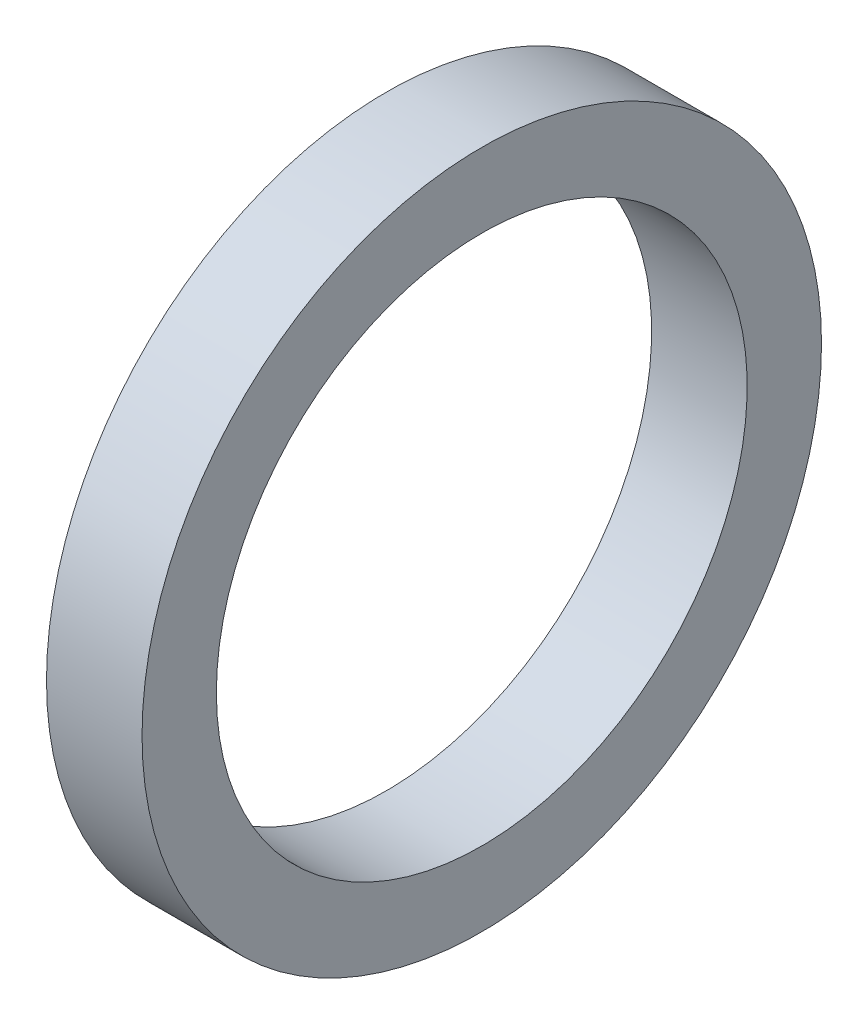
ISO-10303-21;
HEADER;
FILE_DESCRIPTION(('STEP AP214'),'2;1');
FILE_NAME('part.step','',(''),(''),'','','');
FILE_SCHEMA(('AUTOMOTIVE_DESIGN { 1 0 10303 214 1 1 1 1 }'));
ENDSEC;
DATA;
#1=APPLICATION_CONTEXT('core data for automotive mechanical design processes');
#2=APPLICATION_PROTOCOL_DEFINITION('international standard','automotive_design',2000,#1);
#3=PRODUCT_CONTEXT('',#1,'mechanical');
#4=PRODUCT('Part','Part','',(#3));
#5=PRODUCT_RELATED_PRODUCT_CATEGORY('part','',(#4));
#6=PRODUCT_DEFINITION_FORMATION('','',#4);
#7=PRODUCT_DEFINITION_CONTEXT('part definition',#1,'design');
#8=PRODUCT_DEFINITION('design','',#6,#7);
#9=PRODUCT_DEFINITION_SHAPE('','',#8);
#10=(LENGTH_UNIT() NAMED_UNIT(*) SI_UNIT(.MILLI.,.METRE.));
#11=(NAMED_UNIT(*) PLANE_ANGLE_UNIT() SI_UNIT($,.RADIAN.));
#12=(NAMED_UNIT(*) SI_UNIT($,.STERADIAN.) SOLID_ANGLE_UNIT());
#13=UNCERTAINTY_MEASURE_WITH_UNIT(LENGTH_MEASURE(1.E-05),#10,'distance_accuracy_value','');
#14=(GEOMETRIC_REPRESENTATION_CONTEXT(3) GLOBAL_UNCERTAINTY_ASSIGNED_CONTEXT((#13)) GLOBAL_UNIT_ASSIGNED_CONTEXT((#10,
#11,#12)) REPRESENTATION_CONTEXT('',''));
#15=CARTESIAN_POINT('',(0.,0.,0.));
#16=DIRECTION('',(0.,0.,1.));
#17=DIRECTION('',(1.,0.,0.));
#18=AXIS2_PLACEMENT_3D('',#15,#16,#17);
#19=CARTESIAN_POINT('',(-2.5,16.,0.));
#20=DIRECTION('',(1.,0.,0.));
#21=DIRECTION('',(0.,0.,-1.));
#22=AXIS2_PLACEMENT_3D('',#19,#20,#21);
#23=PLANE('',#22);
#24=CARTESIAN_POINT('',(-2.5,0.,0.));
#25=DIRECTION('',(-1.,0.,0.));
#26=DIRECTION('',(0.,0.,1.));
#27=AXIS2_PLACEMENT_3D('',#24,#25,#26);
#28=CIRCLE('',#27,12.5);
#29=CARTESIAN_POINT('',(-2.5,0.,12.5));
#30=VERTEX_POINT('',#29);
#31=EDGE_CURVE('E10',#30,#30,#28,.T.);
#32=ORIENTED_EDGE('',*,*,#31,.F.);
#33=EDGE_LOOP('',(#32));
#34=FACE_BOUND('',#33,.T.);
#35=CARTESIAN_POINT('',(-2.5,0.,0.));
#36=DIRECTION('',(-1.,0.,0.));
#37=DIRECTION('',(0.,0.,1.));
#38=AXIS2_PLACEMENT_3D('',#35,#36,#37);
#39=CIRCLE('',#38,16.);
#40=CARTESIAN_POINT('',(-2.5,0.,16.));
#41=VERTEX_POINT('',#40);
#42=EDGE_CURVE('E44',#41,#41,#39,.T.);
#43=ORIENTED_EDGE('',*,*,#42,.T.);
#44=EDGE_LOOP('',(#43));
#45=FACE_BOUND('',#44,.T.);
#46=ADVANCED_FACE('F30',(#34,#45),#23,.F.);
#47=CARTESIAN_POINT('',(-5.63830467687097,0.,0.));
#48=DIRECTION('',(-1.,0.,0.));
#49=DIRECTION('',(0.,0.,1.));
#50=AXIS2_PLACEMENT_3D('',#47,#48,#49);
#51=CYLINDRICAL_SURFACE('',#50,12.5);
#52=CARTESIAN_POINT('',(2.,0.,0.));
#53=DIRECTION('',(-1.,0.,0.));
#54=DIRECTION('',(0.,0.,1.));
#55=AXIS2_PLACEMENT_3D('',#52,#53,#54);
#56=CIRCLE('',#55,12.5);
#57=CARTESIAN_POINT('',(2.,0.,12.5));
#58=VERTEX_POINT('',#57);
#59=EDGE_CURVE('E36',#58,#58,#56,.T.);
#60=ORIENTED_EDGE('',*,*,#59,.F.);
#61=EDGE_LOOP('',(#60));
#62=FACE_BOUND('',#61,.T.);
#63=ORIENTED_EDGE('',*,*,#31,.T.);
#64=EDGE_LOOP('',(#63));
#65=FACE_BOUND('',#64,.T.);
#66=ADVANCED_FACE('F59',(#62,#65),#51,.F.);
#67=CARTESIAN_POINT('',(2.,12.5,0.));
#68=DIRECTION('',(-1.,0.,0.));
#69=DIRECTION('',(0.,0.,1.));
#70=AXIS2_PLACEMENT_3D('',#67,#68,#69);
#71=PLANE('',#70);
#72=CARTESIAN_POINT('',(2.,0.,0.));
#73=DIRECTION('',(-1.,0.,0.));
#74=DIRECTION('',(0.,0.,1.));
#75=AXIS2_PLACEMENT_3D('',#72,#73,#74);
#76=CIRCLE('',#75,16.);
#77=CARTESIAN_POINT('',(2.,0.,16.));
#78=VERTEX_POINT('',#77);
#79=EDGE_CURVE('E40',#78,#78,#76,.T.);
#80=ORIENTED_EDGE('',*,*,#79,.F.);
#81=EDGE_LOOP('',(#80));
#82=FACE_BOUND('',#81,.T.);
#83=ORIENTED_EDGE('',*,*,#59,.T.);
#84=EDGE_LOOP('',(#83));
#85=FACE_BOUND('',#84,.T.);
#86=ADVANCED_FACE('F54',(#82,#85),#71,.F.);
#87=CARTESIAN_POINT('',(-5.63830467687097,0.,0.));
#88=DIRECTION('',(-1.,0.,0.));
#89=DIRECTION('',(0.,0.,1.));
#90=AXIS2_PLACEMENT_3D('',#87,#88,#89);
#91=CYLINDRICAL_SURFACE('',#90,16.);
#92=ORIENTED_EDGE('',*,*,#42,.F.);
#93=EDGE_LOOP('',(#92));
#94=FACE_BOUND('',#93,.T.);
#95=ORIENTED_EDGE('',*,*,#79,.T.);
#96=EDGE_LOOP('',(#95));
#97=FACE_BOUND('',#96,.T.);
#98=ADVANCED_FACE('F51',(#94,#97),#91,.T.);
#99=CLOSED_SHELL('',(#46,#66,#86,#98));
#100=MANIFOLD_SOLID_BREP('B2',#99);
#101=ADVANCED_BREP_SHAPE_REPRESENTATION('',(#18,#100),#14);
#102=SHAPE_DEFINITION_REPRESENTATION(#9,#101);
ENDSEC;
END-ISO-10303-21;
